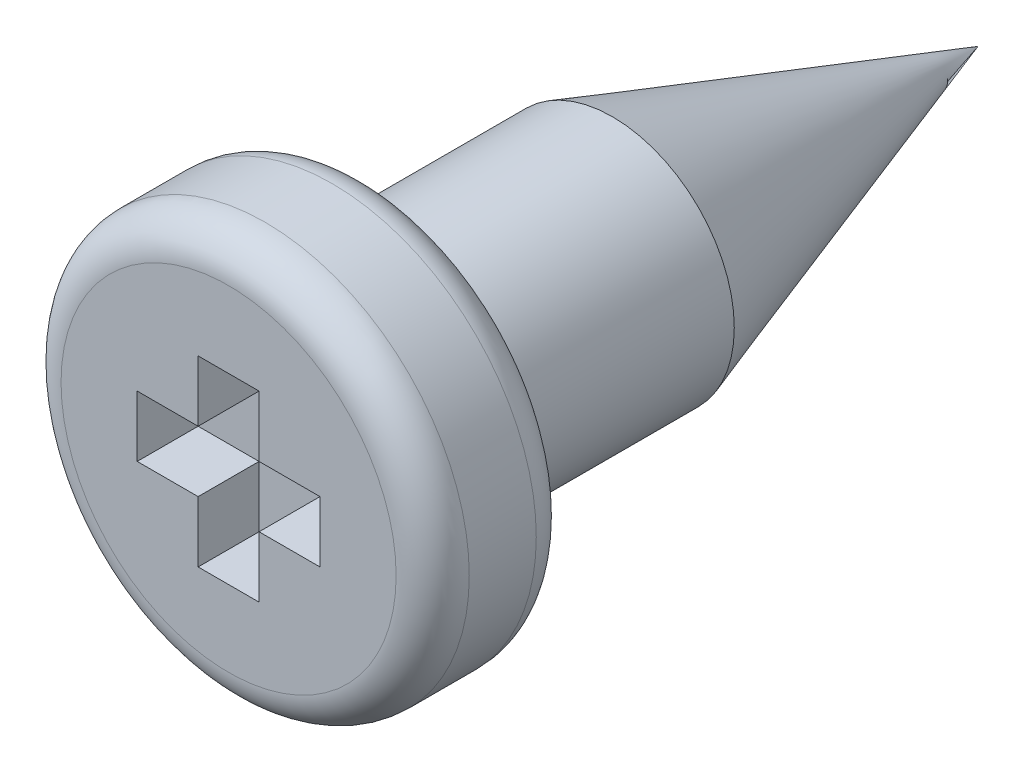
ISO-10303-21;
HEADER;
FILE_DESCRIPTION(('STEP AP214'),'2;1');
FILE_NAME('part.step','',(''),(''),'','','');
FILE_SCHEMA(('AUTOMOTIVE_DESIGN { 1 0 10303 214 1 1 1 1 }'));
ENDSEC;
DATA;
#1=APPLICATION_CONTEXT('core data for automotive mechanical design processes');
#2=APPLICATION_PROTOCOL_DEFINITION('international standard','automotive_design',2000,#1);
#3=PRODUCT_CONTEXT('',#1,'mechanical');
#4=PRODUCT('Part','Part','',(#3));
#5=PRODUCT_RELATED_PRODUCT_CATEGORY('part','',(#4));
#6=PRODUCT_DEFINITION_FORMATION('','',#4);
#7=PRODUCT_DEFINITION_CONTEXT('part definition',#1,'design');
#8=PRODUCT_DEFINITION('design','',#6,#7);
#9=PRODUCT_DEFINITION_SHAPE('','',#8);
#10=(LENGTH_UNIT() NAMED_UNIT(*) SI_UNIT(.MILLI.,.METRE.));
#11=(NAMED_UNIT(*) PLANE_ANGLE_UNIT() SI_UNIT($,.RADIAN.));
#12=(NAMED_UNIT(*) SI_UNIT($,.STERADIAN.) SOLID_ANGLE_UNIT());
#13=UNCERTAINTY_MEASURE_WITH_UNIT(LENGTH_MEASURE(1.E-05),#10,'distance_accuracy_value','');
#14=(GEOMETRIC_REPRESENTATION_CONTEXT(3) GLOBAL_UNCERTAINTY_ASSIGNED_CONTEXT((#13)) GLOBAL_UNIT_ASSIGNED_CONTEXT((#10,
#11,#12)) REPRESENTATION_CONTEXT('',''));
#15=CARTESIAN_POINT('',(0.,0.,0.));
#16=DIRECTION('',(0.,0.,1.));
#17=DIRECTION('',(1.,0.,0.));
#18=AXIS2_PLACEMENT_3D('',#15,#16,#17);
#19=CARTESIAN_POINT('',(0.,0.,0.));
#20=DIRECTION('',(0.,0.,-1.));
#21=DIRECTION('',(1.,0.,0.));
#22=AXIS2_PLACEMENT_3D('',#19,#20,#21);
#23=CYLINDRICAL_SURFACE('',#22,1.);
#24=CARTESIAN_POINT('',(0.,0.,-2.));
#25=DIRECTION('',(0.,0.,-1.));
#26=DIRECTION('',(1.,0.,0.));
#27=AXIS2_PLACEMENT_3D('',#24,#25,#26);
#28=CIRCLE('',#27,1.);
#29=CARTESIAN_POINT('',(-1.,0.,-2.));
#30=VERTEX_POINT('',#29);
#31=EDGE_CURVE('E28',#30,#30,#28,.T.);
#32=ORIENTED_EDGE('',*,*,#31,.F.);
#33=DIRECTION('',(0.,0.,1.));
#34=VECTOR('',#33,1.);
#35=CARTESIAN_POINT('',(-1.,0.,0.));
#36=LINE('',#35,#34);
#37=CARTESIAN_POINT('',(-1.,0.,0.));
#38=VERTEX_POINT('',#37);
#39=EDGE_CURVE('E11',#30,#38,#36,.T.);
#40=ORIENTED_EDGE('',*,*,#39,.T.);
#41=CARTESIAN_POINT('',(0.,0.,0.));
#42=DIRECTION('',(0.,0.,1.));
#43=DIRECTION('',(1.,0.,0.));
#44=AXIS2_PLACEMENT_3D('',#41,#42,#43);
#45=CIRCLE('',#44,1.);
#46=EDGE_CURVE('E259',#38,#38,#45,.T.);
#47=ORIENTED_EDGE('',*,*,#46,.F.);
#48=ORIENTED_EDGE('',*,*,#39,.F.);
#49=EDGE_LOOP('',(#32,#40,#47,#48));
#50=FACE_BOUND('',#49,.T.);
#51=ADVANCED_FACE('F17',(#50),#23,.T.);
#52=CARTESIAN_POINT('',(0.,0.,-2.));
#53=DIRECTION('',(0.,0.,1.));
#54=DIRECTION('',(1.,0.,0.));
#55=AXIS2_PLACEMENT_3D('',#52,#53,#54);
#56=CONICAL_SURFACE('',#55,1.,0.321750554396642);
#57=DIRECTION('',(-0.316227766016838,0.,0.948683298050514));
#58=VECTOR('',#57,1.);
#59=CARTESIAN_POINT('',(-1.,0.,-2.));
#60=LINE('',#59,#58);
#61=CARTESIAN_POINT('',(0.,0.,-5.));
#62=VERTEX_POINT('',#61);
#63=EDGE_CURVE('E322',#62,#30,#60,.T.);
#64=ORIENTED_EDGE('',*,*,#63,.T.);
#65=ORIENTED_EDGE('',*,*,#31,.T.);
#66=ORIENTED_EDGE('',*,*,#63,.F.);
#67=EDGE_LOOP('',(#64,#65,#66));
#68=FACE_BOUND('',#67,.T.);
#69=ADVANCED_FACE('F370',(#68),#56,.T.);
#70=CARTESIAN_POINT('',(0.,0.,0.));
#71=DIRECTION('',(0.,0.,1.));
#72=DIRECTION('',(1.,0.,0.));
#73=AXIS2_PLACEMENT_3D('',#70,#71,#72);
#74=PLANE('',#73);
#75=ORIENTED_EDGE('',*,*,#46,.T.);
#76=EDGE_LOOP('',(#75));
#77=FACE_BOUND('',#76,.T.);
#78=CARTESIAN_POINT('',(0.,0.,0.));
#79=DIRECTION('',(0.,0.,1.));
#80=DIRECTION('',(1.,0.,0.));
#81=AXIS2_PLACEMENT_3D('',#78,#79,#80);
#82=CIRCLE('',#81,1.375);
#83=CARTESIAN_POINT('',(-1.375,0.,0.));
#84=VERTEX_POINT('',#83);
#85=EDGE_CURVE('E256',#84,#84,#82,.T.);
#86=ORIENTED_EDGE('',*,*,#85,.F.);
#87=EDGE_LOOP('',(#86));
#88=FACE_BOUND('',#87,.T.);
#89=ADVANCED_FACE('F367',(#77,#88),#74,.F.);
#90=CARTESIAN_POINT('',(0.,0.,0.3));
#91=DIRECTION('',(0.,0.,1.));
#92=DIRECTION('',(1.,0.,0.));
#93=AXIS2_PLACEMENT_3D('',#90,#91,#92);
#94=TOROIDAL_SURFACE('',#93,1.375,0.3);
#95=CARTESIAN_POINT('',(0.,0.,0.3));
#96=DIRECTION('',(0.,0.,-1.));
#97=DIRECTION('',(1.,0.,0.));
#98=AXIS2_PLACEMENT_3D('',#95,#96,#97);
#99=CIRCLE('',#98,1.675);
#100=CARTESIAN_POINT('',(-1.675,0.,0.3));
#101=VERTEX_POINT('',#100);
#102=EDGE_CURVE('E303',#101,#101,#99,.T.);
#103=ORIENTED_EDGE('',*,*,#102,.T.);
#104=CARTESIAN_POINT('',(-1.375,0.,0.3));
#105=DIRECTION('',(0.,-1.,0.));
#106=DIRECTION('',(-1.,0.,0.));
#107=AXIS2_PLACEMENT_3D('',#104,#105,#106);
#108=CIRCLE('',#107,0.3);
#109=EDGE_CURVE('E94',#101,#84,#108,.T.);
#110=ORIENTED_EDGE('',*,*,#109,.T.);
#111=ORIENTED_EDGE('',*,*,#85,.T.);
#112=ORIENTED_EDGE('',*,*,#109,.F.);
#113=EDGE_LOOP('',(#103,#110,#111,#112));
#114=FACE_BOUND('',#113,.T.);
#115=ADVANCED_FACE('F359',(#114),#94,.T.);
#116=CARTESIAN_POINT('',(0.,0.,1.15));
#117=DIRECTION('',(0.,0.,1.));
#118=DIRECTION('',(1.,0.,0.));
#119=AXIS2_PLACEMENT_3D('',#116,#117,#118);
#120=PLANE('',#119);
#121=DIRECTION('',(0.,-1.,0.));
#122=VECTOR('',#121,1.);
#123=CARTESIAN_POINT('',(0.249999994412065,-0.124999997206032,1.15));
#124=LINE('',#123,#122);
#125=CARTESIAN_POINT('',(0.249999994412065,-0.249999994412065,1.15));
#126=VERTEX_POINT('',#125);
#127=CARTESIAN_POINT('',(0.249999994412065,-0.749999983236194,1.15));
#128=VERTEX_POINT('',#127);
#129=EDGE_CURVE('E253',#126,#128,#124,.T.);
#130=ORIENTED_EDGE('',*,*,#129,.T.);
#131=DIRECTION('',(-1.,0.,0.));
#132=VECTOR('',#131,1.);
#133=CARTESIAN_POINT('',(0.124999997206032,-0.749999983236194,1.15));
#134=LINE('',#133,#132);
#135=CARTESIAN_POINT('',(-0.249999994412065,-0.749999983236194,1.15));
#136=VERTEX_POINT('',#135);
#137=EDGE_CURVE('E135',#128,#136,#134,.T.);
#138=ORIENTED_EDGE('',*,*,#137,.T.);
#139=DIRECTION('',(0.,1.,0.));
#140=VECTOR('',#139,1.);
#141=CARTESIAN_POINT('',(-0.249999994412065,-0.374999991618097,1.15));
#142=LINE('',#141,#140);
#143=CARTESIAN_POINT('',(-0.249999994412065,-0.249999994412065,1.15));
#144=VERTEX_POINT('',#143);
#145=EDGE_CURVE('E309',#136,#144,#142,.T.);
#146=ORIENTED_EDGE('',*,*,#145,.T.);
#147=DIRECTION('',(-1.,0.,0.));
#148=VECTOR('',#147,1.);
#149=CARTESIAN_POINT('',(-0.124999997206032,-0.249999994412065,1.15));
#150=LINE('',#149,#148);
#151=CARTESIAN_POINT('',(-0.749999983236194,-0.249999994412065,1.15));
#152=VERTEX_POINT('',#151);
#153=EDGE_CURVE('E243',#144,#152,#150,.T.);
#154=ORIENTED_EDGE('',*,*,#153,.T.);
#155=DIRECTION('',(0.,1.,0.));
#156=VECTOR('',#155,1.);
#157=CARTESIAN_POINT('',(-0.749999983236194,-0.124999997206032,1.15));
#158=LINE('',#157,#156);
#159=CARTESIAN_POINT('',(-0.749999983236194,0.249999994412065,1.15));
#160=VERTEX_POINT('',#159);
#161=EDGE_CURVE('E190',#152,#160,#158,.T.);
#162=ORIENTED_EDGE('',*,*,#161,.T.);
#163=DIRECTION('',(1.,0.,0.));
#164=VECTOR('',#163,1.);
#165=CARTESIAN_POINT('',(-0.374999991618097,0.249999994412065,1.15));
#166=LINE('',#165,#164);
#167=CARTESIAN_POINT('',(-0.249999994412065,0.249999994412065,1.15));
#168=VERTEX_POINT('',#167);
#169=EDGE_CURVE('E220',#160,#168,#166,.T.);
#170=ORIENTED_EDGE('',*,*,#169,.T.);
#171=DIRECTION('',(0.,1.,0.));
#172=VECTOR('',#171,1.);
#173=CARTESIAN_POINT('',(-0.249999994412065,0.124999997206032,1.15));
#174=LINE('',#173,#172);
#175=CARTESIAN_POINT('',(-0.249999994412065,0.749999983236194,1.15));
#176=VERTEX_POINT('',#175);
#177=EDGE_CURVE('E223',#168,#176,#174,.T.);
#178=ORIENTED_EDGE('',*,*,#177,.T.);
#179=DIRECTION('',(1.,0.,0.));
#180=VECTOR('',#179,1.);
#181=CARTESIAN_POINT('',(-0.124999997206032,0.749999983236194,1.15));
#182=LINE('',#181,#180);
#183=CARTESIAN_POINT('',(0.249999994412065,0.749999983236194,1.15));
#184=VERTEX_POINT('',#183);
#185=EDGE_CURVE('E266',#176,#184,#182,.T.);
#186=ORIENTED_EDGE('',*,*,#185,.T.);
#187=DIRECTION('',(0.,-1.,0.));
#188=VECTOR('',#187,1.);
#189=CARTESIAN_POINT('',(0.249999994412065,0.374999991618097,1.15));
#190=LINE('',#189,#188);
#191=CARTESIAN_POINT('',(0.249999994412065,0.249999994412065,1.15));
#192=VERTEX_POINT('',#191);
#193=EDGE_CURVE('E165',#184,#192,#190,.T.);
#194=ORIENTED_EDGE('',*,*,#193,.T.);
#195=DIRECTION('',(1.,0.,0.));
#196=VECTOR('',#195,1.);
#197=CARTESIAN_POINT('',(0.124999997206032,0.249999994412065,1.15));
#198=LINE('',#197,#196);
#199=CARTESIAN_POINT('',(0.749999983236194,0.249999994412065,1.15));
#200=VERTEX_POINT('',#199);
#201=EDGE_CURVE('E263',#192,#200,#198,.T.);
#202=ORIENTED_EDGE('',*,*,#201,.T.);
#203=DIRECTION('',(0.,-1.,0.));
#204=VECTOR('',#203,1.);
#205=CARTESIAN_POINT('',(0.749999983236194,0.124999997206032,1.15));
#206=LINE('',#205,#204);
#207=CARTESIAN_POINT('',(0.749999983236194,-0.249999994412065,1.15));
#208=VERTEX_POINT('',#207);
#209=EDGE_CURVE('E315',#200,#208,#206,.T.);
#210=ORIENTED_EDGE('',*,*,#209,.T.);
#211=DIRECTION('',(-1.,0.,0.));
#212=VECTOR('',#211,1.);
#213=CARTESIAN_POINT('',(0.374999991618097,-0.249999994412065,1.15));
#214=LINE('',#213,#212);
#215=EDGE_CURVE('E233',#208,#126,#214,.T.);
#216=ORIENTED_EDGE('',*,*,#215,.T.);
#217=EDGE_LOOP('',(#130,#138,#146,#154,#162,#170,#178,#186,#194,#202,#210,#216));
#218=FACE_BOUND('',#217,.T.);
#219=CARTESIAN_POINT('',(0.,0.,1.15));
#220=DIRECTION('',(0.,0.,-1.));
#221=DIRECTION('',(1.,0.,0.));
#222=AXIS2_PLACEMENT_3D('',#219,#220,#221);
#223=CIRCLE('',#222,1.375);
#224=CARTESIAN_POINT('',(-1.375,0.,1.15));
#225=VERTEX_POINT('',#224);
#226=EDGE_CURVE('E271',#225,#225,#223,.T.);
#227=ORIENTED_EDGE('',*,*,#226,.F.);
#228=EDGE_LOOP('',(#227));
#229=FACE_BOUND('',#228,.T.);
#230=ADVANCED_FACE('F19',(#218,#229),#120,.T.);
#231=CARTESIAN_POINT('',(0.,0.,0.));
#232=DIRECTION('',(0.,0.,1.));
#233=DIRECTION('',(1.,0.,0.));
#234=AXIS2_PLACEMENT_3D('',#231,#232,#233);
#235=CYLINDRICAL_SURFACE('',#234,1.675);
#236=CARTESIAN_POINT('',(0.,0.,0.85));
#237=DIRECTION('',(0.,0.,1.));
#238=DIRECTION('',(1.,0.,0.));
#239=AXIS2_PLACEMENT_3D('',#236,#237,#238);
#240=CIRCLE('',#239,1.675);
#241=CARTESIAN_POINT('',(-1.675,0.,0.85));
#242=VERTEX_POINT('',#241);
#243=EDGE_CURVE('E286',#242,#242,#240,.T.);
#244=ORIENTED_EDGE('',*,*,#243,.F.);
#245=DIRECTION('',(0.,0.,-1.));
#246=VECTOR('',#245,1.);
#247=CARTESIAN_POINT('',(-1.675,0.,0.));
#248=LINE('',#247,#246);
#249=EDGE_CURVE('E81',#242,#101,#248,.T.);
#250=ORIENTED_EDGE('',*,*,#249,.T.);
#251=ORIENTED_EDGE('',*,*,#102,.F.);
#252=ORIENTED_EDGE('',*,*,#249,.F.);
#253=EDGE_LOOP('',(#244,#250,#251,#252));
#254=FACE_BOUND('',#253,.T.);
#255=ADVANCED_FACE('F353',(#254),#235,.T.);
#256=CARTESIAN_POINT('',(0.,0.,0.85));
#257=DIRECTION('',(0.,0.,1.));
#258=DIRECTION('',(1.,0.,0.));
#259=AXIS2_PLACEMENT_3D('',#256,#257,#258);
#260=TOROIDAL_SURFACE('',#259,1.375,0.3);
#261=ORIENTED_EDGE('',*,*,#226,.T.);
#262=CARTESIAN_POINT('',(-1.375,0.,0.85));
#263=DIRECTION('',(0.,-1.,0.));
#264=DIRECTION('',(-1.,0.,0.));
#265=AXIS2_PLACEMENT_3D('',#262,#263,#264);
#266=CIRCLE('',#265,0.3);
#267=EDGE_CURVE('E289',#225,#242,#266,.T.);
#268=ORIENTED_EDGE('',*,*,#267,.T.);
#269=ORIENTED_EDGE('',*,*,#243,.T.);
#270=ORIENTED_EDGE('',*,*,#267,.F.);
#271=EDGE_LOOP('',(#261,#268,#269,#270));
#272=FACE_BOUND('',#271,.T.);
#273=ADVANCED_FACE('F355',(#272),#260,.T.);
#274=CARTESIAN_POINT('',(0.,0.,0.65));
#275=DIRECTION('',(0.,0.,-1.));
#276=DIRECTION('',(0.,-1.,0.));
#277=AXIS2_PLACEMENT_3D('',#274,#275,#276);
#278=PLANE('',#277);
#279=DIRECTION('',(-1.,0.,0.));
#280=VECTOR('',#279,1.);
#281=CARTESIAN_POINT('',(0.249999994412065,-0.749999983236194,0.65));
#282=LINE('',#281,#280);
#283=CARTESIAN_POINT('',(0.249999994412065,-0.749999983236194,0.65));
#284=VERTEX_POINT('',#283);
#285=CARTESIAN_POINT('',(-0.249999994412065,-0.749999983236194,0.65));
#286=VERTEX_POINT('',#285);
#287=EDGE_CURVE('E267',#284,#286,#282,.T.);
#288=ORIENTED_EDGE('',*,*,#287,.F.);
#289=DIRECTION('',(0.,-1.,0.));
#290=VECTOR('',#289,1.);
#291=CARTESIAN_POINT('',(0.249999994412065,0.749999983236194,0.65));
#292=LINE('',#291,#290);
#293=CARTESIAN_POINT('',(0.249999994412065,-0.249999994412065,0.65));
#294=VERTEX_POINT('',#293);
#295=EDGE_CURVE('E252',#294,#284,#292,.T.);
#296=ORIENTED_EDGE('',*,*,#295,.F.);
#297=DIRECTION('',(-1.,0.,0.));
#298=VECTOR('',#297,1.);
#299=CARTESIAN_POINT('',(0.749999983236194,-0.249999994412065,0.65));
#300=LINE('',#299,#298);
#301=CARTESIAN_POINT('',(0.749999983236194,-0.249999994412065,0.65));
#302=VERTEX_POINT('',#301);
#303=EDGE_CURVE('E147',#302,#294,#300,.T.);
#304=ORIENTED_EDGE('',*,*,#303,.F.);
#305=DIRECTION('',(0.,-1.,0.));
#306=VECTOR('',#305,1.);
#307=CARTESIAN_POINT('',(0.749999983236194,0.249999994412065,0.65));
#308=LINE('',#307,#306);
#309=CARTESIAN_POINT('',(0.749999983236194,0.249999994412065,0.65));
#310=VERTEX_POINT('',#309);
#311=EDGE_CURVE('E275',#310,#302,#308,.T.);
#312=ORIENTED_EDGE('',*,*,#311,.F.);
#313=DIRECTION('',(1.,0.,0.));
#314=VECTOR('',#313,1.);
#315=CARTESIAN_POINT('',(-0.749999983236194,0.249999994412065,0.65));
#316=LINE('',#315,#314);
#317=CARTESIAN_POINT('',(0.249999994412065,0.249999994412065,0.65));
#318=VERTEX_POINT('',#317);
#319=EDGE_CURVE('E21',#318,#310,#316,.T.);
#320=ORIENTED_EDGE('',*,*,#319,.F.);
#321=DIRECTION('',(0.,-1.,0.));
#322=VECTOR('',#321,1.);
#323=CARTESIAN_POINT('',(0.249999994412065,0.749999983236194,0.65));
#324=LINE('',#323,#322);
#325=CARTESIAN_POINT('',(0.249999994412065,0.749999983236194,0.65));
#326=VERTEX_POINT('',#325);
#327=EDGE_CURVE('E242',#326,#318,#324,.T.);
#328=ORIENTED_EDGE('',*,*,#327,.F.);
#329=DIRECTION('',(1.,0.,0.));
#330=VECTOR('',#329,1.);
#331=CARTESIAN_POINT('',(-0.249999994412065,0.749999983236194,0.65));
#332=LINE('',#331,#330);
#333=CARTESIAN_POINT('',(-0.249999994412065,0.749999983236194,0.65));
#334=VERTEX_POINT('',#333);
#335=EDGE_CURVE('E215',#334,#326,#332,.T.);
#336=ORIENTED_EDGE('',*,*,#335,.F.);
#337=DIRECTION('',(0.,1.,0.));
#338=VECTOR('',#337,1.);
#339=CARTESIAN_POINT('',(-0.249999994412065,-0.749999983236194,0.65));
#340=LINE('',#339,#338);
#341=CARTESIAN_POINT('',(-0.249999994412065,0.249999994412065,0.65));
#342=VERTEX_POINT('',#341);
#343=EDGE_CURVE('E212',#342,#334,#340,.T.);
#344=ORIENTED_EDGE('',*,*,#343,.F.);
#345=DIRECTION('',(1.,0.,0.));
#346=VECTOR('',#345,1.);
#347=CARTESIAN_POINT('',(-0.749999983236194,0.249999994412065,0.65));
#348=LINE('',#347,#346);
#349=CARTESIAN_POINT('',(-0.749999983236194,0.249999994412065,0.65));
#350=VERTEX_POINT('',#349);
#351=EDGE_CURVE('E199',#350,#342,#348,.T.);
#352=ORIENTED_EDGE('',*,*,#351,.F.);
#353=DIRECTION('',(0.,1.,0.));
#354=VECTOR('',#353,1.);
#355=CARTESIAN_POINT('',(-0.749999983236194,-0.249999994412065,0.65));
#356=LINE('',#355,#354);
#357=CARTESIAN_POINT('',(-0.749999983236194,-0.249999994412065,0.65));
#358=VERTEX_POINT('',#357);
#359=EDGE_CURVE('E247',#358,#350,#356,.T.);
#360=ORIENTED_EDGE('',*,*,#359,.F.);
#361=DIRECTION('',(-1.,0.,0.));
#362=VECTOR('',#361,1.);
#363=CARTESIAN_POINT('',(0.749999983236194,-0.249999994412065,0.65));
#364=LINE('',#363,#362);
#365=CARTESIAN_POINT('',(-0.249999994412065,-0.249999994412065,0.65));
#366=VERTEX_POINT('',#365);
#367=EDGE_CURVE('E285',#366,#358,#364,.T.);
#368=ORIENTED_EDGE('',*,*,#367,.F.);
#369=DIRECTION('',(0.,1.,0.));
#370=VECTOR('',#369,1.);
#371=CARTESIAN_POINT('',(-0.249999994412065,-0.749999983236194,0.65));
#372=LINE('',#371,#370);
#373=EDGE_CURVE('E299',#286,#366,#372,.T.);
#374=ORIENTED_EDGE('',*,*,#373,.F.);
#375=EDGE_LOOP('',(#288,#296,#304,#312,#320,#328,#336,#344,#352,#360,#368,#374));
#376=FACE_BOUND('',#375,.T.);
#377=ADVANCED_FACE('F213',(#376),#278,.F.);
#378=CARTESIAN_POINT('',(0.249999994412065,-0.749999983236194,1.15));
#379=DIRECTION('',(0.,-1.,0.));
#380=DIRECTION('',(0.,0.,-1.));
#381=AXIS2_PLACEMENT_3D('',#378,#379,#380);
#382=PLANE('',#381);
#383=ORIENTED_EDGE('',*,*,#137,.F.);
#384=DIRECTION('',(0.,0.,-1.));
#385=VECTOR('',#384,1.);
#386=CARTESIAN_POINT('',(0.249999994412065,-0.749999983236194,1.15));
#387=LINE('',#386,#385);
#388=EDGE_CURVE('E272',#128,#284,#387,.T.);
#389=ORIENTED_EDGE('',*,*,#388,.T.);
#390=ORIENTED_EDGE('',*,*,#287,.T.);
#391=DIRECTION('',(0.,0.,-1.));
#392=VECTOR('',#391,1.);
#393=CARTESIAN_POINT('',(-0.249999994412065,-0.749999983236194,1.15));
#394=LINE('',#393,#392);
#395=EDGE_CURVE('E302',#136,#286,#394,.T.);
#396=ORIENTED_EDGE('',*,*,#395,.F.);
#397=EDGE_LOOP('',(#383,#389,#390,#396));
#398=FACE_BOUND('',#397,.T.);
#399=ADVANCED_FACE('F395',(#398),#382,.F.);
#400=CARTESIAN_POINT('',(-0.249999994412065,-0.749999983236194,1.15));
#401=DIRECTION('',(-1.,0.,0.));
#402=DIRECTION('',(0.,0.,1.));
#403=AXIS2_PLACEMENT_3D('',#400,#401,#402);
#404=PLANE('',#403);
#405=ORIENTED_EDGE('',*,*,#145,.F.);
#406=ORIENTED_EDGE('',*,*,#395,.T.);
#407=ORIENTED_EDGE('',*,*,#373,.T.);
#408=DIRECTION('',(0.,0.,-1.));
#409=VECTOR('',#408,1.);
#410=CARTESIAN_POINT('',(-0.249999994412065,-0.249999994412065,1.15));
#411=LINE('',#410,#409);
#412=EDGE_CURVE('E246',#144,#366,#411,.T.);
#413=ORIENTED_EDGE('',*,*,#412,.F.);
#414=EDGE_LOOP('',(#405,#406,#407,#413));
#415=FACE_BOUND('',#414,.T.);
#416=ADVANCED_FACE('F386',(#415),#404,.F.);
#417=CARTESIAN_POINT('',(-0.249999994412065,-0.249999994412065,1.15));
#418=DIRECTION('',(0.,-1.,0.));
#419=DIRECTION('',(0.,0.,-1.));
#420=AXIS2_PLACEMENT_3D('',#417,#418,#419);
#421=PLANE('',#420);
#422=ORIENTED_EDGE('',*,*,#153,.F.);
#423=ORIENTED_EDGE('',*,*,#412,.T.);
#424=ORIENTED_EDGE('',*,*,#367,.T.);
#425=DIRECTION('',(0.,0.,-1.));
#426=VECTOR('',#425,1.);
#427=CARTESIAN_POINT('',(-0.749999983236194,-0.249999994412065,1.15));
#428=LINE('',#427,#426);
#429=EDGE_CURVE('E281',#152,#358,#428,.T.);
#430=ORIENTED_EDGE('',*,*,#429,.F.);
#431=EDGE_LOOP('',(#422,#423,#424,#430));
#432=FACE_BOUND('',#431,.T.);
#433=ADVANCED_FACE('F382',(#432),#421,.F.);
#434=CARTESIAN_POINT('',(-0.749999983236194,-0.249999994412065,1.15));
#435=DIRECTION('',(-1.,0.,0.));
#436=DIRECTION('',(0.,0.,1.));
#437=AXIS2_PLACEMENT_3D('',#434,#435,#436);
#438=PLANE('',#437);
#439=ORIENTED_EDGE('',*,*,#161,.F.);
#440=ORIENTED_EDGE('',*,*,#429,.T.);
#441=ORIENTED_EDGE('',*,*,#359,.T.);
#442=DIRECTION('',(0.,0.,-1.));
#443=VECTOR('',#442,1.);
#444=CARTESIAN_POINT('',(-0.749999983236194,0.249999994412065,1.15));
#445=LINE('',#444,#443);
#446=EDGE_CURVE('E206',#160,#350,#445,.T.);
#447=ORIENTED_EDGE('',*,*,#446,.F.);
#448=EDGE_LOOP('',(#439,#440,#441,#447));
#449=FACE_BOUND('',#448,.T.);
#450=ADVANCED_FACE('F385',(#449),#438,.F.);
#451=CARTESIAN_POINT('',(-0.749999983236194,0.249999994412065,1.15));
#452=DIRECTION('',(0.,1.,0.));
#453=DIRECTION('',(1.,0.,0.));
#454=AXIS2_PLACEMENT_3D('',#451,#452,#453);
#455=PLANE('',#454);
#456=ORIENTED_EDGE('',*,*,#169,.F.);
#457=ORIENTED_EDGE('',*,*,#446,.T.);
#458=ORIENTED_EDGE('',*,*,#351,.T.);
#459=DIRECTION('',(0.,0.,-1.));
#460=VECTOR('',#459,1.);
#461=CARTESIAN_POINT('',(-0.249999994412065,0.249999994412065,1.15));
#462=LINE('',#461,#460);
#463=EDGE_CURVE('E204',#168,#342,#462,.T.);
#464=ORIENTED_EDGE('',*,*,#463,.F.);
#465=EDGE_LOOP('',(#456,#457,#458,#464));
#466=FACE_BOUND('',#465,.T.);
#467=ADVANCED_FACE('F202',(#466),#455,.F.);
#468=CARTESIAN_POINT('',(-0.249999994412065,0.249999994412065,1.15));
#469=DIRECTION('',(-1.,0.,0.));
#470=DIRECTION('',(0.,0.,1.));
#471=AXIS2_PLACEMENT_3D('',#468,#469,#470);
#472=PLANE('',#471);
#473=ORIENTED_EDGE('',*,*,#177,.F.);
#474=ORIENTED_EDGE('',*,*,#463,.T.);
#475=ORIENTED_EDGE('',*,*,#343,.T.);
#476=DIRECTION('',(0.,0.,-1.));
#477=VECTOR('',#476,1.);
#478=CARTESIAN_POINT('',(-0.249999994412065,0.749999983236194,1.15));
#479=LINE('',#478,#477);
#480=EDGE_CURVE('E320',#176,#334,#479,.T.);
#481=ORIENTED_EDGE('',*,*,#480,.F.);
#482=EDGE_LOOP('',(#473,#474,#475,#481));
#483=FACE_BOUND('',#482,.T.);
#484=ADVANCED_FACE('F222',(#483),#472,.F.);
#485=CARTESIAN_POINT('',(-0.249999994412065,0.749999983236194,1.15));
#486=DIRECTION('',(0.,1.,0.));
#487=DIRECTION('',(1.,0.,0.));
#488=AXIS2_PLACEMENT_3D('',#485,#486,#487);
#489=PLANE('',#488);
#490=ORIENTED_EDGE('',*,*,#185,.F.);
#491=ORIENTED_EDGE('',*,*,#480,.T.);
#492=ORIENTED_EDGE('',*,*,#335,.T.);
#493=DIRECTION('',(0.,0.,-1.));
#494=VECTOR('',#493,1.);
#495=CARTESIAN_POINT('',(0.249999994412065,0.749999983236194,1.15));
#496=LINE('',#495,#494);
#497=EDGE_CURVE('E238',#184,#326,#496,.T.);
#498=ORIENTED_EDGE('',*,*,#497,.F.);
#499=EDGE_LOOP('',(#490,#491,#492,#498));
#500=FACE_BOUND('',#499,.T.);
#501=ADVANCED_FACE('F381',(#500),#489,.F.);
#502=CARTESIAN_POINT('',(0.249999994412065,0.749999983236194,1.15));
#503=DIRECTION('',(1.,0.,0.));
#504=DIRECTION('',(0.,1.,0.));
#505=AXIS2_PLACEMENT_3D('',#502,#503,#504);
#506=PLANE('',#505);
#507=ORIENTED_EDGE('',*,*,#193,.F.);
#508=ORIENTED_EDGE('',*,*,#497,.T.);
#509=ORIENTED_EDGE('',*,*,#327,.T.);
#510=DIRECTION('',(0.,0.,-1.));
#511=VECTOR('',#510,1.);
#512=CARTESIAN_POINT('',(0.249999994412065,0.249999994412065,1.15));
#513=LINE('',#512,#511);
#514=EDGE_CURVE('E260',#192,#318,#513,.T.);
#515=ORIENTED_EDGE('',*,*,#514,.F.);
#516=EDGE_LOOP('',(#507,#508,#509,#515));
#517=FACE_BOUND('',#516,.T.);
#518=ADVANCED_FACE('F401',(#517),#506,.F.);
#519=CARTESIAN_POINT('',(0.249999994412065,0.249999994412065,1.15));
#520=DIRECTION('',(0.,1.,0.));
#521=DIRECTION('',(1.,0.,0.));
#522=AXIS2_PLACEMENT_3D('',#519,#520,#521);
#523=PLANE('',#522);
#524=ORIENTED_EDGE('',*,*,#201,.F.);
#525=ORIENTED_EDGE('',*,*,#514,.T.);
#526=ORIENTED_EDGE('',*,*,#319,.T.);
#527=DIRECTION('',(0.,0.,-1.));
#528=VECTOR('',#527,1.);
#529=CARTESIAN_POINT('',(0.749999983236194,0.249999994412065,1.15));
#530=LINE('',#529,#528);
#531=EDGE_CURVE('E277',#200,#310,#530,.T.);
#532=ORIENTED_EDGE('',*,*,#531,.F.);
#533=EDGE_LOOP('',(#524,#525,#526,#532));
#534=FACE_BOUND('',#533,.T.);
#535=ADVANCED_FACE('F397',(#534),#523,.F.);
#536=CARTESIAN_POINT('',(0.749999983236194,0.249999994412065,1.15));
#537=DIRECTION('',(1.,0.,0.));
#538=DIRECTION('',(0.,1.,0.));
#539=AXIS2_PLACEMENT_3D('',#536,#537,#538);
#540=PLANE('',#539);
#541=ORIENTED_EDGE('',*,*,#209,.F.);
#542=ORIENTED_EDGE('',*,*,#531,.T.);
#543=ORIENTED_EDGE('',*,*,#311,.T.);
#544=DIRECTION('',(0.,0.,-1.));
#545=VECTOR('',#544,1.);
#546=CARTESIAN_POINT('',(0.749999983236194,-0.249999994412065,1.15));
#547=LINE('',#546,#545);
#548=EDGE_CURVE('E235',#208,#302,#547,.T.);
#549=ORIENTED_EDGE('',*,*,#548,.F.);
#550=EDGE_LOOP('',(#541,#542,#543,#549));
#551=FACE_BOUND('',#550,.T.);
#552=ADVANCED_FACE('F400',(#551),#540,.F.);
#553=CARTESIAN_POINT('',(0.749999983236194,-0.249999994412065,1.15));
#554=DIRECTION('',(0.,-1.,0.));
#555=DIRECTION('',(0.,0.,-1.));
#556=AXIS2_PLACEMENT_3D('',#553,#554,#555);
#557=PLANE('',#556);
#558=ORIENTED_EDGE('',*,*,#215,.F.);
#559=ORIENTED_EDGE('',*,*,#548,.T.);
#560=ORIENTED_EDGE('',*,*,#303,.T.);
#561=DIRECTION('',(0.,0.,-1.));
#562=VECTOR('',#561,1.);
#563=CARTESIAN_POINT('',(0.249999994412065,-0.249999994412065,1.15));
#564=LINE('',#563,#562);
#565=EDGE_CURVE('E248',#126,#294,#564,.T.);
#566=ORIENTED_EDGE('',*,*,#565,.F.);
#567=EDGE_LOOP('',(#558,#559,#560,#566));
#568=FACE_BOUND('',#567,.T.);
#569=ADVANCED_FACE('F404',(#568),#557,.F.);
#570=CARTESIAN_POINT('',(0.249999994412065,-0.249999994412065,1.15));
#571=DIRECTION('',(1.,0.,0.));
#572=DIRECTION('',(0.,1.,0.));
#573=AXIS2_PLACEMENT_3D('',#570,#571,#572);
#574=PLANE('',#573);
#575=ORIENTED_EDGE('',*,*,#129,.F.);
#576=ORIENTED_EDGE('',*,*,#565,.T.);
#577=ORIENTED_EDGE('',*,*,#295,.T.);
#578=ORIENTED_EDGE('',*,*,#388,.F.);
#579=EDGE_LOOP('',(#575,#576,#577,#578));
#580=FACE_BOUND('',#579,.T.);
#581=ADVANCED_FACE('F406',(#580),#574,.F.);
#582=CLOSED_SHELL('',(#51,#69,#89,#115,#230,#255,#273,#377,#399,#416,#433,#450,#467,#484,#501,
#518,#535,#552,#569,#581));
#583=MANIFOLD_SOLID_BREP('B1',#582);
#584=ADVANCED_BREP_SHAPE_REPRESENTATION('',(#18,#583),#14);
#585=SHAPE_DEFINITION_REPRESENTATION(#9,#584);
ENDSEC;
END-ISO-10303-21;
